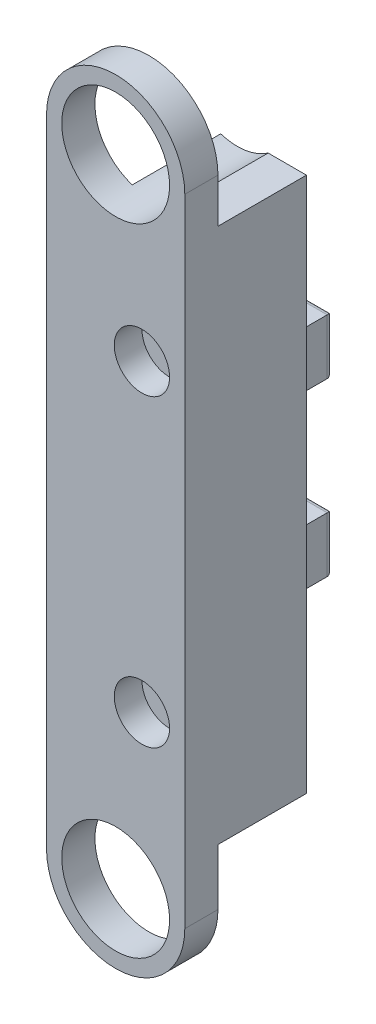
ISO-10303-21;
HEADER;
FILE_DESCRIPTION(('STEP AP214'),'2;1');
FILE_NAME('part.step','',(''),(''),'','','');
FILE_SCHEMA(('AUTOMOTIVE_DESIGN { 1 0 10303 214 1 1 1 1 }'));
ENDSEC;
DATA;
#1=APPLICATION_CONTEXT('core data for automotive mechanical design processes');
#2=APPLICATION_PROTOCOL_DEFINITION('international standard','automotive_design',2000,#1);
#3=PRODUCT_CONTEXT('',#1,'mechanical');
#4=PRODUCT('Part','Part','',(#3));
#5=PRODUCT_RELATED_PRODUCT_CATEGORY('part','',(#4));
#6=PRODUCT_DEFINITION_FORMATION('','',#4);
#7=PRODUCT_DEFINITION_CONTEXT('part definition',#1,'design');
#8=PRODUCT_DEFINITION('design','',#6,#7);
#9=PRODUCT_DEFINITION_SHAPE('','',#8);
#10=(LENGTH_UNIT() NAMED_UNIT(*) SI_UNIT(.MILLI.,.METRE.));
#11=(NAMED_UNIT(*) PLANE_ANGLE_UNIT() SI_UNIT($,.RADIAN.));
#12=(NAMED_UNIT(*) SI_UNIT($,.STERADIAN.) SOLID_ANGLE_UNIT());
#13=UNCERTAINTY_MEASURE_WITH_UNIT(LENGTH_MEASURE(1.E-05),#10,'distance_accuracy_value','');
#14=(GEOMETRIC_REPRESENTATION_CONTEXT(3) GLOBAL_UNCERTAINTY_ASSIGNED_CONTEXT((#13)) GLOBAL_UNIT_ASSIGNED_CONTEXT((#10,
#11,#12)) REPRESENTATION_CONTEXT('',''));
#15=CARTESIAN_POINT('',(0.,0.,0.));
#16=DIRECTION('',(0.,0.,1.));
#17=DIRECTION('',(1.,0.,0.));
#18=AXIS2_PLACEMENT_3D('',#15,#16,#17);
#19=CARTESIAN_POINT('',(12.5,0.,13.));
#20=DIRECTION('',(0.,0.,1.));
#21=DIRECTION('',(1.,0.,0.));
#22=AXIS2_PLACEMENT_3D('',#19,#20,#21);
#23=PLANE('',#22);
#24=DIRECTION('',(0.,-1.,0.));
#25=VECTOR('',#24,1.);
#26=CARTESIAN_POINT('',(7.24999999999999,68.,13.));
#27=LINE('',#26,#25);
#28=CARTESIAN_POINT('',(7.24999999999999,78.,13.));
#29=VERTEX_POINT('',#28);
#30=CARTESIAN_POINT('',(7.24999999999999,68.,13.));
#31=VERTEX_POINT('',#30);
#32=EDGE_CURVE('E276',#29,#31,#27,.T.);
#33=ORIENTED_EDGE('',*,*,#32,.F.);
#34=DIRECTION('',(1.,0.,0.));
#35=VECTOR('',#34,1.);
#36=CARTESIAN_POINT('',(2.24999999999999,78.,13.));
#37=LINE('',#36,#35);
#38=CARTESIAN_POINT('',(2.24999999999999,78.,13.));
#39=VERTEX_POINT('',#38);
#40=EDGE_CURVE('E285',#39,#29,#37,.T.);
#41=ORIENTED_EDGE('',*,*,#40,.F.);
#42=DIRECTION('',(0.,1.,0.));
#43=VECTOR('',#42,1.);
#44=CARTESIAN_POINT('',(2.24999999999999,68.,13.));
#45=LINE('',#44,#43);
#46=CARTESIAN_POINT('',(2.24999999999999,68.,13.));
#47=VERTEX_POINT('',#46);
#48=EDGE_CURVE('E282',#47,#39,#45,.T.);
#49=ORIENTED_EDGE('',*,*,#48,.F.);
#50=DIRECTION('',(-1.,0.,0.));
#51=VECTOR('',#50,1.);
#52=CARTESIAN_POINT('',(2.24999999999999,68.,13.));
#53=LINE('',#52,#51);
#54=EDGE_CURVE('E279',#31,#47,#53,.T.);
#55=ORIENTED_EDGE('',*,*,#54,.F.);
#56=EDGE_LOOP('',(#33,#41,#49,#55));
#57=FACE_BOUND('',#56,.T.);
#58=CARTESIAN_POINT('',(4.74999999999999,30.,13.));
#59=DIRECTION('',(0.,0.,-1.));
#60=DIRECTION('',(-1.,0.,0.));
#61=AXIS2_PLACEMENT_3D('',#58,#59,#60);
#62=CIRCLE('',#61,2.);
#63=CARTESIAN_POINT('',(2.74999999999999,30.,13.));
#64=VERTEX_POINT('',#63);
#65=EDGE_CURVE('E309',#64,#64,#62,.T.);
#66=ORIENTED_EDGE('',*,*,#65,.F.);
#67=EDGE_LOOP('',(#66));
#68=FACE_BOUND('',#67,.T.);
#69=CARTESIAN_POINT('',(4.74999999999999,85.,13.));
#70=DIRECTION('',(0.,0.,-1.));
#71=DIRECTION('',(-1.,0.,0.));
#72=AXIS2_PLACEMENT_3D('',#69,#70,#71);
#73=CIRCLE('',#72,2.);
#74=CARTESIAN_POINT('',(2.74999999999999,85.,13.));
#75=VERTEX_POINT('',#74);
#76=EDGE_CURVE('E313',#75,#75,#73,.T.);
#77=ORIENTED_EDGE('',*,*,#76,.F.);
#78=EDGE_LOOP('',(#77));
#79=FACE_BOUND('',#78,.T.);
#80=DIRECTION('',(-1.,0.,0.));
#81=VECTOR('',#80,1.);
#82=CARTESIAN_POINT('',(0.,107.,13.));
#83=LINE('',#82,#81);
#84=CARTESIAN_POINT('',(12.5,107.,13.));
#85=VERTEX_POINT('',#84);
#86=CARTESIAN_POINT('',(5.57337420240197,107.,13.));
#87=VERTEX_POINT('',#86);
#88=EDGE_CURVE('E382',#85,#87,#83,.T.);
#89=ORIENTED_EDGE('',*,*,#88,.F.);
#90=DIRECTION('',(0.,1.,0.));
#91=VECTOR('',#90,1.);
#92=CARTESIAN_POINT('',(12.5,0.,13.));
#93=LINE('',#92,#91);
#94=CARTESIAN_POINT('',(12.5,10.1740958378372,13.));
#95=VERTEX_POINT('',#94);
#96=EDGE_CURVE('E312',#95,#85,#93,.T.);
#97=ORIENTED_EDGE('',*,*,#96,.F.);
#98=DIRECTION('',(-1.,0.,0.));
#99=VECTOR('',#98,1.);
#100=CARTESIAN_POINT('',(0.,10.1740958378372,13.));
#101=LINE('',#100,#99);
#102=CARTESIAN_POINT('',(9.61705640424888,10.1740958378372,13.));
#103=VERTEX_POINT('',#102);
#104=EDGE_CURVE('E324',#95,#103,#101,.T.);
#105=ORIENTED_EDGE('',*,*,#104,.T.);
#106=CARTESIAN_POINT('',(0.,0.,13.));
#107=DIRECTION('',(0.,0.,1.));
#108=DIRECTION('',(1.,0.,0.));
#109=AXIS2_PLACEMENT_3D('',#106,#107,#108);
#110=CIRCLE('',#109,14.);
#111=CARTESIAN_POINT('',(0.,14.,13.));
#112=VERTEX_POINT('',#111);
#113=EDGE_CURVE('E321',#112,#103,#110,.F.);
#114=ORIENTED_EDGE('',*,*,#113,.F.);
#115=CARTESIAN_POINT('',(0.,26.5,13.));
#116=DIRECTION('',(0.,0.,1.));
#117=DIRECTION('',(1.,0.,0.));
#118=AXIS2_PLACEMENT_3D('',#115,#116,#117);
#119=CIRCLE('',#118,12.5);
#120=CARTESIAN_POINT('',(-2.99999999999999,14.3653389004884,13.));
#121=VERTEX_POINT('',#120);
#122=EDGE_CURVE('E351',#121,#112,#119,.T.);
#123=ORIENTED_EDGE('',*,*,#122,.F.);
#124=DIRECTION('',(0.,1.,0.));
#125=VECTOR('',#124,1.);
#126=CARTESIAN_POINT('',(-2.99999999999999,0.,13.));
#127=LINE('',#126,#125);
#128=CARTESIAN_POINT('',(-2.99999999999999,47.9080663039864,13.));
#129=VERTEX_POINT('',#128);
#130=EDGE_CURVE('E327',#121,#129,#127,.T.);
#131=ORIENTED_EDGE('',*,*,#130,.T.);
#132=CARTESIAN_POINT('',(-13.,58.,13.));
#133=DIRECTION('',(0.,0.,1.));
#134=DIRECTION('',(1.,0.,0.));
#135=AXIS2_PLACEMENT_3D('',#132,#133,#134);
#136=CIRCLE('',#135,14.2072912873896);
#137=CARTESIAN_POINT('',(-2.99999999999999,68.0919336960136,13.));
#138=VERTEX_POINT('',#137);
#139=EDGE_CURVE('E329',#129,#138,#136,.T.);
#140=ORIENTED_EDGE('',*,*,#139,.T.);
#141=DIRECTION('',(0.,1.,0.));
#142=VECTOR('',#141,1.);
#143=CARTESIAN_POINT('',(-2.99999999999999,0.,13.));
#144=LINE('',#143,#142);
#145=CARTESIAN_POINT('',(-2.99999999999999,105.72301234236,13.));
#146=VERTEX_POINT('',#145);
#147=EDGE_CURVE('E332',#138,#146,#144,.T.);
#148=ORIENTED_EDGE('',*,*,#147,.T.);
#149=CARTESIAN_POINT('',(0.,115.,13.));
#150=DIRECTION('',(0.,0.,1.));
#151=DIRECTION('',(1.,0.,0.));
#152=AXIS2_PLACEMENT_3D('',#149,#150,#151);
#153=CIRCLE('',#152,9.75);
#154=EDGE_CURVE('E319',#146,#87,#153,.T.);
#155=ORIENTED_EDGE('',*,*,#154,.T.);
#156=EDGE_LOOP('',(#89,#97,#105,#114,#123,#131,#140,#148,#155));
#157=FACE_BOUND('',#156,.T.);
#158=DIRECTION('',(0.,-1.,0.));
#159=VECTOR('',#158,1.);
#160=CARTESIAN_POINT('',(7.24999999999999,37.,13.));
#161=LINE('',#160,#159);
#162=CARTESIAN_POINT('',(7.24999999999999,47.,13.));
#163=VERTEX_POINT('',#162);
#164=CARTESIAN_POINT('',(7.24999999999999,37.,13.));
#165=VERTEX_POINT('',#164);
#166=EDGE_CURVE('E245',#163,#165,#161,.T.);
#167=ORIENTED_EDGE('',*,*,#166,.F.);
#168=DIRECTION('',(1.,0.,0.));
#169=VECTOR('',#168,1.);
#170=CARTESIAN_POINT('',(2.24999999999999,47.,13.));
#171=LINE('',#170,#169);
#172=CARTESIAN_POINT('',(2.24999999999998,47.,13.));
#173=VERTEX_POINT('',#172);
#174=EDGE_CURVE('E253',#173,#163,#171,.T.);
#175=ORIENTED_EDGE('',*,*,#174,.F.);
#176=DIRECTION('',(0.,1.,0.));
#177=VECTOR('',#176,1.);
#178=CARTESIAN_POINT('',(2.24999999999999,37.,13.));
#179=LINE('',#178,#177);
#180=CARTESIAN_POINT('',(2.24999999999998,37.,13.));
#181=VERTEX_POINT('',#180);
#182=EDGE_CURVE('E266',#181,#173,#179,.T.);
#183=ORIENTED_EDGE('',*,*,#182,.F.);
#184=DIRECTION('',(-1.,0.,0.));
#185=VECTOR('',#184,1.);
#186=CARTESIAN_POINT('',(2.24999999999999,37.,13.));
#187=LINE('',#186,#185);
#188=EDGE_CURVE('E261',#165,#181,#187,.T.);
#189=ORIENTED_EDGE('',*,*,#188,.F.);
#190=EDGE_LOOP('',(#167,#175,#183,#189));
#191=FACE_BOUND('',#190,.T.);
#192=ADVANCED_FACE('F73',(#57,#68,#79,#157,#191),#23,.F.);
#193=CARTESIAN_POINT('',(4.74999999999999,85.,35.));
#194=DIRECTION('',(0.,0.,-1.));
#195=DIRECTION('',(-1.,0.,0.));
#196=AXIS2_PLACEMENT_3D('',#193,#194,#195);
#197=CYLINDRICAL_SURFACE('',#196,2.);
#198=ORIENTED_EDGE('',*,*,#76,.T.);
#199=EDGE_LOOP('',(#198));
#200=FACE_BOUND('',#199,.T.);
#201=CARTESIAN_POINT('',(4.74999999999999,85.,30.));
#202=DIRECTION('',(0.,0.,1.));
#203=DIRECTION('',(1.,0.,0.));
#204=AXIS2_PLACEMENT_3D('',#201,#202,#203);
#205=CIRCLE('',#204,2.);
#206=CARTESIAN_POINT('',(6.74999999999999,85.,30.));
#207=VERTEX_POINT('',#206);
#208=EDGE_CURVE('E316',#207,#207,#205,.F.);
#209=ORIENTED_EDGE('',*,*,#208,.F.);
#210=EDGE_LOOP('',(#209));
#211=FACE_BOUND('',#210,.T.);
#212=ADVANCED_FACE('F513',(#200,#211),#197,.F.);
#213=CARTESIAN_POINT('',(4.74999999999999,30.,35.));
#214=DIRECTION('',(0.,0.,-1.));
#215=DIRECTION('',(-1.,0.,0.));
#216=AXIS2_PLACEMENT_3D('',#213,#214,#215);
#217=CYLINDRICAL_SURFACE('',#216,2.);
#218=ORIENTED_EDGE('',*,*,#65,.T.);
#219=EDGE_LOOP('',(#218));
#220=FACE_BOUND('',#219,.T.);
#221=CARTESIAN_POINT('',(4.74999999999999,30.,30.));
#222=DIRECTION('',(0.,0.,1.));
#223=DIRECTION('',(1.,0.,0.));
#224=AXIS2_PLACEMENT_3D('',#221,#222,#223);
#225=CIRCLE('',#224,2.);
#226=CARTESIAN_POINT('',(6.74999999999999,30.,30.));
#227=VERTEX_POINT('',#226);
#228=EDGE_CURVE('E300',#227,#227,#225,.F.);
#229=ORIENTED_EDGE('',*,*,#228,.F.);
#230=EDGE_LOOP('',(#229));
#231=FACE_BOUND('',#230,.T.);
#232=ADVANCED_FACE('F520',(#220,#231),#217,.F.);
#233=CARTESIAN_POINT('',(0.,115.,35.));
#234=DIRECTION('',(0.,0.,-1.));
#235=DIRECTION('',(-1.,0.,0.));
#236=AXIS2_PLACEMENT_3D('',#233,#234,#235);
#237=CYLINDRICAL_SURFACE('',#236,9.75);
#238=ORIENTED_EDGE('',*,*,#154,.F.);
#239=DIRECTION('',(0.,0.,1.));
#240=VECTOR('',#239,1.);
#241=CARTESIAN_POINT('',(-2.99999999999999,105.72301234236,13.));
#242=LINE('',#241,#240);
#243=CARTESIAN_POINT('',(-2.99999999999999,105.72301234236,29.));
#244=VERTEX_POINT('',#243);
#245=EDGE_CURVE('E341',#146,#244,#242,.T.);
#246=ORIENTED_EDGE('',*,*,#245,.T.);
#247=CARTESIAN_POINT('',(0.,115.,29.));
#248=DIRECTION('',(0.,0.,1.));
#249=DIRECTION('',(1.,0.,0.));
#250=AXIS2_PLACEMENT_3D('',#247,#248,#249);
#251=CIRCLE('',#250,9.75);
#252=CARTESIAN_POINT('',(5.57337420240197,107.,29.));
#253=VERTEX_POINT('',#252);
#254=EDGE_CURVE('E386',#244,#253,#251,.F.);
#255=ORIENTED_EDGE('',*,*,#254,.T.);
#256=DIRECTION('',(0.,0.,1.));
#257=VECTOR('',#256,1.);
#258=CARTESIAN_POINT('',(5.57337420240197,107.,13.));
#259=LINE('',#258,#257);
#260=EDGE_CURVE('E360',#87,#253,#259,.T.);
#261=ORIENTED_EDGE('',*,*,#260,.F.);
#262=EDGE_LOOP('',(#238,#246,#255,#261));
#263=FACE_BOUND('',#262,.T.);
#264=CARTESIAN_POINT('',(0.,115.,35.));
#265=DIRECTION('',(0.,0.,1.));
#266=DIRECTION('',(1.,0.,0.));
#267=AXIS2_PLACEMENT_3D('',#264,#265,#266);
#268=CIRCLE('',#267,9.75);
#269=CARTESIAN_POINT('',(9.75,115.,35.));
#270=VERTEX_POINT('',#269);
#271=EDGE_CURVE('E409',#270,#270,#268,.T.);
#272=ORIENTED_EDGE('',*,*,#271,.T.);
#273=EDGE_LOOP('',(#272));
#274=FACE_BOUND('',#273,.T.);
#275=ADVANCED_FACE('F569',(#263,#274),#237,.F.);
#276=CARTESIAN_POINT('',(-12.5,0.,35.));
#277=DIRECTION('',(1.,0.,0.));
#278=DIRECTION('',(0.,1.,0.));
#279=AXIS2_PLACEMENT_3D('',#276,#277,#278);
#280=PLANE('',#279);
#281=DIRECTION('',(0.,0.,-1.));
#282=VECTOR('',#281,1.);
#283=CARTESIAN_POINT('',(-12.5,115.,35.));
#284=LINE('',#283,#282);
#285=CARTESIAN_POINT('',(-12.5,115.,35.));
#286=VERTEX_POINT('',#285);
#287=CARTESIAN_POINT('',(-12.5,115.,29.));
#288=VERTEX_POINT('',#287);
#289=EDGE_CURVE('E421',#286,#288,#284,.T.);
#290=ORIENTED_EDGE('',*,*,#289,.T.);
#291=DIRECTION('',(0.,-1.,0.));
#292=VECTOR('',#291,1.);
#293=CARTESIAN_POINT('',(-12.5,0.,29.));
#294=LINE('',#293,#292);
#295=CARTESIAN_POINT('',(-12.5,0.,29.));
#296=VERTEX_POINT('',#295);
#297=EDGE_CURVE('E368',#288,#296,#294,.T.);
#298=ORIENTED_EDGE('',*,*,#297,.T.);
#299=DIRECTION('',(0.,0.,-1.));
#300=VECTOR('',#299,1.);
#301=CARTESIAN_POINT('',(-12.5,0.,35.));
#302=LINE('',#301,#300);
#303=CARTESIAN_POINT('',(-12.5,0.,35.));
#304=VERTEX_POINT('',#303);
#305=EDGE_CURVE('E418',#304,#296,#302,.T.);
#306=ORIENTED_EDGE('',*,*,#305,.F.);
#307=DIRECTION('',(0.,-1.,0.));
#308=VECTOR('',#307,1.);
#309=CARTESIAN_POINT('',(-12.5,0.,35.));
#310=LINE('',#309,#308);
#311=EDGE_CURVE('E405',#286,#304,#310,.T.);
#312=ORIENTED_EDGE('',*,*,#311,.F.);
#313=EDGE_LOOP('',(#290,#298,#306,#312));
#314=FACE_BOUND('',#313,.T.);
#315=ADVANCED_FACE('F572',(#314),#280,.F.);
#316=CARTESIAN_POINT('',(12.5,0.,35.));
#317=DIRECTION('',(1.,0.,0.));
#318=DIRECTION('',(0.,1.,0.));
#319=AXIS2_PLACEMENT_3D('',#316,#317,#318);
#320=PLANE('',#319);
#321=ORIENTED_EDGE('',*,*,#96,.T.);
#322=DIRECTION('',(0.,0.,1.));
#323=VECTOR('',#322,1.);
#324=CARTESIAN_POINT('',(12.5,107.,13.));
#325=LINE('',#324,#323);
#326=CARTESIAN_POINT('',(12.5,107.,29.));
#327=VERTEX_POINT('',#326);
#328=EDGE_CURVE('E385',#85,#327,#325,.T.);
#329=ORIENTED_EDGE('',*,*,#328,.T.);
#330=DIRECTION('',(0.,1.,0.));
#331=VECTOR('',#330,1.);
#332=CARTESIAN_POINT('',(12.5,0.,29.));
#333=LINE('',#332,#331);
#334=CARTESIAN_POINT('',(12.5,115.,29.));
#335=VERTEX_POINT('',#334);
#336=EDGE_CURVE('E389',#327,#335,#333,.T.);
#337=ORIENTED_EDGE('',*,*,#336,.T.);
#338=DIRECTION('',(0.,0.,-1.));
#339=VECTOR('',#338,1.);
#340=CARTESIAN_POINT('',(12.5,115.,35.));
#341=LINE('',#340,#339);
#342=CARTESIAN_POINT('',(12.5,115.,35.));
#343=VERTEX_POINT('',#342);
#344=EDGE_CURVE('E424',#343,#335,#341,.T.);
#345=ORIENTED_EDGE('',*,*,#344,.F.);
#346=DIRECTION('',(0.,-1.,0.));
#347=VECTOR('',#346,1.);
#348=CARTESIAN_POINT('',(12.5,0.,35.));
#349=LINE('',#348,#347);
#350=CARTESIAN_POINT('',(12.5,0.,35.));
#351=VERTEX_POINT('',#350);
#352=EDGE_CURVE('E378',#343,#351,#349,.T.);
#353=ORIENTED_EDGE('',*,*,#352,.T.);
#354=DIRECTION('',(0.,0.,-1.));
#355=VECTOR('',#354,1.);
#356=CARTESIAN_POINT('',(12.5,0.,35.));
#357=LINE('',#356,#355);
#358=CARTESIAN_POINT('',(12.5,0.,29.));
#359=VERTEX_POINT('',#358);
#360=EDGE_CURVE('E415',#351,#359,#357,.T.);
#361=ORIENTED_EDGE('',*,*,#360,.T.);
#362=DIRECTION('',(0.,1.,0.));
#363=VECTOR('',#362,1.);
#364=CARTESIAN_POINT('',(12.5,0.,29.));
#365=LINE('',#364,#363);
#366=CARTESIAN_POINT('',(12.5,10.1740958378372,29.));
#367=VERTEX_POINT('',#366);
#368=EDGE_CURVE('E356',#359,#367,#365,.T.);
#369=ORIENTED_EDGE('',*,*,#368,.T.);
#370=DIRECTION('',(0.,0.,1.));
#371=VECTOR('',#370,1.);
#372=CARTESIAN_POINT('',(12.5,10.1740958378372,13.));
#373=LINE('',#372,#371);
#374=EDGE_CURVE('E354',#95,#367,#373,.T.);
#375=ORIENTED_EDGE('',*,*,#374,.F.);
#376=EDGE_LOOP('',(#321,#329,#337,#345,#353,#361,#369,#375));
#377=FACE_BOUND('',#376,.T.);
#378=ADVANCED_FACE('F579',(#377),#320,.T.);
#379=CARTESIAN_POINT('',(0.,115.,35.));
#380=DIRECTION('',(0.,0.,-1.));
#381=DIRECTION('',(-1.,0.,0.));
#382=AXIS2_PLACEMENT_3D('',#379,#380,#381);
#383=CYLINDRICAL_SURFACE('',#382,12.5);
#384=ORIENTED_EDGE('',*,*,#344,.T.);
#385=CARTESIAN_POINT('',(0.,115.,29.));
#386=DIRECTION('',(0.,0.,1.));
#387=DIRECTION('',(1.,0.,0.));
#388=AXIS2_PLACEMENT_3D('',#385,#386,#387);
#389=CIRCLE('',#388,12.5);
#390=EDGE_CURVE('E392',#335,#288,#389,.T.);
#391=ORIENTED_EDGE('',*,*,#390,.T.);
#392=ORIENTED_EDGE('',*,*,#289,.F.);
#393=CARTESIAN_POINT('',(0.,115.,35.));
#394=DIRECTION('',(0.,0.,1.));
#395=DIRECTION('',(1.,0.,0.));
#396=AXIS2_PLACEMENT_3D('',#393,#394,#395);
#397=CIRCLE('',#396,12.5);
#398=EDGE_CURVE('E402',#343,#286,#397,.T.);
#399=ORIENTED_EDGE('',*,*,#398,.F.);
#400=EDGE_LOOP('',(#384,#391,#392,#399));
#401=FACE_BOUND('',#400,.T.);
#402=ADVANCED_FACE('F564',(#401),#383,.T.);
#403=CARTESIAN_POINT('',(0.,0.,35.));
#404=DIRECTION('',(0.,0.,1.));
#405=DIRECTION('',(1.,0.,0.));
#406=AXIS2_PLACEMENT_3D('',#403,#404,#405);
#407=PLANE('',#406);
#408=CARTESIAN_POINT('',(4.74999999999999,85.,35.));
#409=DIRECTION('',(0.,0.,1.));
#410=DIRECTION('',(1.,0.,0.));
#411=AXIS2_PLACEMENT_3D('',#408,#409,#410);
#412=CIRCLE('',#411,5.);
#413=CARTESIAN_POINT('',(9.74999999999999,85.,35.));
#414=VERTEX_POINT('',#413);
#415=EDGE_CURVE('E301',#414,#414,#412,.T.);
#416=ORIENTED_EDGE('',*,*,#415,.F.);
#417=EDGE_LOOP('',(#416));
#418=FACE_BOUND('',#417,.T.);
#419=CARTESIAN_POINT('',(4.74999999999999,30.,35.));
#420=DIRECTION('',(0.,0.,1.));
#421=DIRECTION('',(1.,0.,0.));
#422=AXIS2_PLACEMENT_3D('',#419,#420,#421);
#423=CIRCLE('',#422,5.);
#424=CARTESIAN_POINT('',(9.74999999999999,30.,35.));
#425=VERTEX_POINT('',#424);
#426=EDGE_CURVE('E296',#425,#425,#423,.T.);
#427=ORIENTED_EDGE('',*,*,#426,.F.);
#428=EDGE_LOOP('',(#427));
#429=FACE_BOUND('',#428,.T.);
#430=ORIENTED_EDGE('',*,*,#398,.T.);
#431=ORIENTED_EDGE('',*,*,#311,.T.);
#432=CARTESIAN_POINT('',(0.,0.,35.));
#433=DIRECTION('',(0.,0.,1.));
#434=DIRECTION('',(1.,0.,0.));
#435=AXIS2_PLACEMENT_3D('',#432,#433,#434);
#436=CIRCLE('',#435,12.5);
#437=EDGE_CURVE('E407',#304,#351,#436,.T.);
#438=ORIENTED_EDGE('',*,*,#437,.T.);
#439=ORIENTED_EDGE('',*,*,#352,.F.);
#440=EDGE_LOOP('',(#430,#431,#438,#439));
#441=FACE_BOUND('',#440,.T.);
#442=ORIENTED_EDGE('',*,*,#271,.F.);
#443=EDGE_LOOP('',(#442));
#444=FACE_BOUND('',#443,.T.);
#445=CARTESIAN_POINT('',(0.,0.,35.));
#446=DIRECTION('',(0.,0.,1.));
#447=DIRECTION('',(1.,0.,0.));
#448=AXIS2_PLACEMENT_3D('',#445,#446,#447);
#449=CIRCLE('',#448,9.75);
#450=CARTESIAN_POINT('',(9.75,0.,35.));
#451=VERTEX_POINT('',#450);
#452=EDGE_CURVE('E412',#451,#451,#449,.T.);
#453=ORIENTED_EDGE('',*,*,#452,.F.);
#454=EDGE_LOOP('',(#453));
#455=FACE_BOUND('',#454,.T.);
#456=ADVANCED_FACE('F551',(#418,#429,#441,#444,#455),#407,.T.);
#457=CARTESIAN_POINT('',(0.,0.,35.));
#458=DIRECTION('',(0.,0.,-1.));
#459=DIRECTION('',(-1.,0.,0.));
#460=AXIS2_PLACEMENT_3D('',#457,#458,#459);
#461=CYLINDRICAL_SURFACE('',#460,12.5);
#462=ORIENTED_EDGE('',*,*,#305,.T.);
#463=CARTESIAN_POINT('',(0.,0.,29.));
#464=DIRECTION('',(0.,0.,1.));
#465=DIRECTION('',(1.,0.,0.));
#466=AXIS2_PLACEMENT_3D('',#463,#464,#465);
#467=CIRCLE('',#466,12.5);
#468=EDGE_CURVE('E371',#296,#359,#467,.T.);
#469=ORIENTED_EDGE('',*,*,#468,.T.);
#470=ORIENTED_EDGE('',*,*,#360,.F.);
#471=ORIENTED_EDGE('',*,*,#437,.F.);
#472=EDGE_LOOP('',(#462,#469,#470,#471));
#473=FACE_BOUND('',#472,.T.);
#474=ADVANCED_FACE('F563',(#473),#461,.T.);
#475=CARTESIAN_POINT('',(0.,0.,35.));
#476=DIRECTION('',(0.,0.,-1.));
#477=DIRECTION('',(-1.,0.,0.));
#478=AXIS2_PLACEMENT_3D('',#475,#476,#477);
#479=CYLINDRICAL_SURFACE('',#478,9.75);
#480=CARTESIAN_POINT('',(0.,0.,29.));
#481=DIRECTION('',(0.,0.,1.));
#482=DIRECTION('',(1.,0.,0.));
#483=AXIS2_PLACEMENT_3D('',#480,#481,#482);
#484=CIRCLE('',#483,9.75);
#485=CARTESIAN_POINT('',(9.75,0.,29.));
#486=VERTEX_POINT('',#485);
#487=EDGE_CURVE('E355',#486,#486,#484,.F.);
#488=ORIENTED_EDGE('',*,*,#487,.T.);
#489=EDGE_LOOP('',(#488));
#490=FACE_BOUND('',#489,.T.);
#491=ORIENTED_EDGE('',*,*,#452,.T.);
#492=EDGE_LOOP('',(#491));
#493=FACE_BOUND('',#492,.T.);
#494=ADVANCED_FACE('F549',(#490,#493),#479,.F.);
#495=CARTESIAN_POINT('',(0.,26.5,13.));
#496=DIRECTION('',(0.,0.,1.));
#497=DIRECTION('',(1.,0.,0.));
#498=AXIS2_PLACEMENT_3D('',#495,#496,#497);
#499=CYLINDRICAL_SURFACE('',#498,12.5);
#500=DIRECTION('',(0.,0.,1.));
#501=VECTOR('',#500,1.);
#502=CARTESIAN_POINT('',(-2.99999999999999,14.3653389004884,13.));
#503=LINE('',#502,#501);
#504=CARTESIAN_POINT('',(-2.99999999999999,14.3653389004884,29.));
#505=VERTEX_POINT('',#504);
#506=EDGE_CURVE('E344',#121,#505,#503,.T.);
#507=ORIENTED_EDGE('',*,*,#506,.F.);
#508=ORIENTED_EDGE('',*,*,#122,.T.);
#509=DIRECTION('',(0.,0.,1.));
#510=VECTOR('',#509,1.);
#511=CARTESIAN_POINT('',(0.,14.,13.));
#512=LINE('',#511,#510);
#513=CARTESIAN_POINT('',(0.,14.,29.));
#514=VERTEX_POINT('',#513);
#515=EDGE_CURVE('E375',#112,#514,#512,.T.);
#516=ORIENTED_EDGE('',*,*,#515,.T.);
#517=CARTESIAN_POINT('',(0.,26.5,29.));
#518=DIRECTION('',(0.,0.,1.));
#519=DIRECTION('',(1.,0.,0.));
#520=AXIS2_PLACEMENT_3D('',#517,#518,#519);
#521=CIRCLE('',#520,12.5);
#522=EDGE_CURVE('E366',#505,#514,#521,.T.);
#523=ORIENTED_EDGE('',*,*,#522,.F.);
#524=EDGE_LOOP('',(#507,#508,#516,#523));
#525=FACE_BOUND('',#524,.T.);
#526=ADVANCED_FACE('F545',(#525),#499,.T.);
#527=CARTESIAN_POINT('',(0.,0.,13.));
#528=DIRECTION('',(0.,0.,1.));
#529=DIRECTION('',(1.,0.,0.));
#530=AXIS2_PLACEMENT_3D('',#527,#528,#529);
#531=CYLINDRICAL_SURFACE('',#530,14.);
#532=ORIENTED_EDGE('',*,*,#515,.F.);
#533=ORIENTED_EDGE('',*,*,#113,.T.);
#534=DIRECTION('',(0.,0.,1.));
#535=VECTOR('',#534,1.);
#536=CARTESIAN_POINT('',(9.61705640424889,10.1740958378372,13.));
#537=LINE('',#536,#535);
#538=CARTESIAN_POINT('',(9.61705640424889,10.1740958378372,29.));
#539=VERTEX_POINT('',#538);
#540=EDGE_CURVE('E379',#103,#539,#537,.T.);
#541=ORIENTED_EDGE('',*,*,#540,.T.);
#542=CARTESIAN_POINT('',(0.,0.,29.));
#543=DIRECTION('',(0.,0.,1.));
#544=DIRECTION('',(1.,0.,0.));
#545=AXIS2_PLACEMENT_3D('',#542,#543,#544);
#546=CIRCLE('',#545,14.);
#547=EDGE_CURVE('E363',#539,#514,#546,.T.);
#548=ORIENTED_EDGE('',*,*,#547,.T.);
#549=EDGE_LOOP('',(#532,#533,#541,#548));
#550=FACE_BOUND('',#549,.T.);
#551=ADVANCED_FACE('F548',(#550),#531,.F.);
#552=CARTESIAN_POINT('',(0.,10.1740958378372,13.));
#553=DIRECTION('',(0.,-1.,0.));
#554=DIRECTION('',(1.,0.,0.));
#555=AXIS2_PLACEMENT_3D('',#552,#553,#554);
#556=PLANE('',#555);
#557=ORIENTED_EDGE('',*,*,#104,.F.);
#558=ORIENTED_EDGE('',*,*,#374,.T.);
#559=DIRECTION('',(1.,0.,0.));
#560=VECTOR('',#559,1.);
#561=CARTESIAN_POINT('',(0.,10.1740958378372,29.));
#562=LINE('',#561,#560);
#563=EDGE_CURVE('E359',#539,#367,#562,.T.);
#564=ORIENTED_EDGE('',*,*,#563,.F.);
#565=ORIENTED_EDGE('',*,*,#540,.F.);
#566=EDGE_LOOP('',(#557,#558,#564,#565));
#567=FACE_BOUND('',#566,.T.);
#568=ADVANCED_FACE('F543',(#567),#556,.T.);
#569=CARTESIAN_POINT('',(0.,0.,29.));
#570=DIRECTION('',(0.,0.,1.));
#571=DIRECTION('',(1.,0.,0.));
#572=AXIS2_PLACEMENT_3D('',#569,#570,#571);
#573=PLANE('',#572);
#574=ORIENTED_EDGE('',*,*,#297,.F.);
#575=ORIENTED_EDGE('',*,*,#390,.F.);
#576=ORIENTED_EDGE('',*,*,#336,.F.);
#577=DIRECTION('',(-1.,0.,0.));
#578=VECTOR('',#577,1.);
#579=CARTESIAN_POINT('',(0.,107.,29.));
#580=LINE('',#579,#578);
#581=EDGE_CURVE('E350',#327,#253,#580,.T.);
#582=ORIENTED_EDGE('',*,*,#581,.T.);
#583=ORIENTED_EDGE('',*,*,#254,.F.);
#584=DIRECTION('',(0.,1.,0.));
#585=VECTOR('',#584,1.);
#586=CARTESIAN_POINT('',(-2.99999999999999,0.,29.));
#587=LINE('',#586,#585);
#588=CARTESIAN_POINT('',(-2.99999999999999,68.0919336960136,29.));
#589=VERTEX_POINT('',#588);
#590=EDGE_CURVE('E330',#589,#244,#587,.T.);
#591=ORIENTED_EDGE('',*,*,#590,.F.);
#592=CARTESIAN_POINT('',(-13.,58.,29.));
#593=DIRECTION('',(0.,0.,1.));
#594=DIRECTION('',(1.,0.,0.));
#595=AXIS2_PLACEMENT_3D('',#592,#593,#594);
#596=CIRCLE('',#595,14.2072912873896);
#597=CARTESIAN_POINT('',(-2.99999999999999,47.9080663039864,29.));
#598=VERTEX_POINT('',#597);
#599=EDGE_CURVE('E336',#598,#589,#596,.T.);
#600=ORIENTED_EDGE('',*,*,#599,.F.);
#601=DIRECTION('',(0.,1.,0.));
#602=VECTOR('',#601,1.);
#603=CARTESIAN_POINT('',(-2.99999999999999,0.,29.));
#604=LINE('',#603,#602);
#605=EDGE_CURVE('E326',#505,#598,#604,.T.);
#606=ORIENTED_EDGE('',*,*,#605,.F.);
#607=ORIENTED_EDGE('',*,*,#522,.T.);
#608=ORIENTED_EDGE('',*,*,#547,.F.);
#609=ORIENTED_EDGE('',*,*,#563,.T.);
#610=ORIENTED_EDGE('',*,*,#368,.F.);
#611=ORIENTED_EDGE('',*,*,#468,.F.);
#612=EDGE_LOOP('',(#574,#575,#576,#582,#583,#591,#600,#606,#607,#608,#609,#610,#611));
#613=FACE_BOUND('',#612,.T.);
#614=ORIENTED_EDGE('',*,*,#487,.F.);
#615=EDGE_LOOP('',(#614));
#616=FACE_BOUND('',#615,.T.);
#617=ADVANCED_FACE('F540',(#613,#616),#573,.F.);
#618=CARTESIAN_POINT('',(0.,107.,13.));
#619=DIRECTION('',(0.,1.,0.));
#620=DIRECTION('',(0.,0.,1.));
#621=AXIS2_PLACEMENT_3D('',#618,#619,#620);
#622=PLANE('',#621);
#623=ORIENTED_EDGE('',*,*,#581,.F.);
#624=ORIENTED_EDGE('',*,*,#328,.F.);
#625=ORIENTED_EDGE('',*,*,#88,.T.);
#626=ORIENTED_EDGE('',*,*,#260,.T.);
#627=EDGE_LOOP('',(#623,#624,#625,#626));
#628=FACE_BOUND('',#627,.T.);
#629=ADVANCED_FACE('F530',(#628),#622,.T.);
#630=CARTESIAN_POINT('',(-2.99999999999999,0.,13.));
#631=DIRECTION('',(1.,0.,0.));
#632=DIRECTION('',(0.,1.,0.));
#633=AXIS2_PLACEMENT_3D('',#630,#631,#632);
#634=PLANE('',#633);
#635=ORIENTED_EDGE('',*,*,#590,.T.);
#636=ORIENTED_EDGE('',*,*,#245,.F.);
#637=ORIENTED_EDGE('',*,*,#147,.F.);
#638=DIRECTION('',(0.,0.,1.));
#639=VECTOR('',#638,1.);
#640=CARTESIAN_POINT('',(-2.99999999999999,68.0919336960136,13.));
#641=LINE('',#640,#639);
#642=EDGE_CURVE('E345',#138,#589,#641,.T.);
#643=ORIENTED_EDGE('',*,*,#642,.T.);
#644=EDGE_LOOP('',(#635,#636,#637,#643));
#645=FACE_BOUND('',#644,.T.);
#646=ADVANCED_FACE('F526',(#645),#634,.F.);
#647=CARTESIAN_POINT('',(-13.,58.,13.));
#648=DIRECTION('',(0.,0.,1.));
#649=DIRECTION('',(1.,0.,0.));
#650=AXIS2_PLACEMENT_3D('',#647,#648,#649);
#651=CYLINDRICAL_SURFACE('',#650,14.2072912873896);
#652=ORIENTED_EDGE('',*,*,#599,.T.);
#653=ORIENTED_EDGE('',*,*,#642,.F.);
#654=ORIENTED_EDGE('',*,*,#139,.F.);
#655=DIRECTION('',(0.,0.,1.));
#656=VECTOR('',#655,1.);
#657=CARTESIAN_POINT('',(-2.99999999999999,47.9080663039864,13.));
#658=LINE('',#657,#656);
#659=EDGE_CURVE('E334',#129,#598,#658,.T.);
#660=ORIENTED_EDGE('',*,*,#659,.T.);
#661=EDGE_LOOP('',(#652,#653,#654,#660));
#662=FACE_BOUND('',#661,.T.);
#663=ADVANCED_FACE('F529',(#662),#651,.F.);
#664=CARTESIAN_POINT('',(-2.99999999999999,0.,13.));
#665=DIRECTION('',(1.,0.,0.));
#666=DIRECTION('',(0.,1.,0.));
#667=AXIS2_PLACEMENT_3D('',#664,#665,#666);
#668=PLANE('',#667);
#669=ORIENTED_EDGE('',*,*,#506,.T.);
#670=ORIENTED_EDGE('',*,*,#605,.T.);
#671=ORIENTED_EDGE('',*,*,#659,.F.);
#672=ORIENTED_EDGE('',*,*,#130,.F.);
#673=EDGE_LOOP('',(#669,#670,#671,#672));
#674=FACE_BOUND('',#673,.T.);
#675=ADVANCED_FACE('F534',(#674),#668,.F.);
#676=CARTESIAN_POINT('',(4.74999999999999,30.,30.));
#677=DIRECTION('',(0.,0.,1.));
#678=DIRECTION('',(1.,0.,0.));
#679=AXIS2_PLACEMENT_3D('',#676,#677,#678);
#680=PLANE('',#679);
#681=CARTESIAN_POINT('',(4.74999999999999,30.,30.));
#682=DIRECTION('',(0.,0.,1.));
#683=DIRECTION('',(1.,0.,0.));
#684=AXIS2_PLACEMENT_3D('',#681,#682,#683);
#685=CIRCLE('',#684,5.);
#686=CARTESIAN_POINT('',(9.74999999999999,30.,30.));
#687=VERTEX_POINT('',#686);
#688=EDGE_CURVE('E304',#687,#687,#685,.T.);
#689=ORIENTED_EDGE('',*,*,#688,.T.);
#690=EDGE_LOOP('',(#689));
#691=FACE_BOUND('',#690,.T.);
#692=ORIENTED_EDGE('',*,*,#228,.T.);
#693=EDGE_LOOP('',(#692));
#694=FACE_BOUND('',#693,.T.);
#695=ADVANCED_FACE('F538',(#691,#694),#680,.T.);
#696=CARTESIAN_POINT('',(4.74999999999999,30.,30.));
#697=DIRECTION('',(0.,0.,1.));
#698=DIRECTION('',(1.,0.,0.));
#699=AXIS2_PLACEMENT_3D('',#696,#697,#698);
#700=CYLINDRICAL_SURFACE('',#699,5.);
#701=ORIENTED_EDGE('',*,*,#688,.F.);
#702=EDGE_LOOP('',(#701));
#703=FACE_BOUND('',#702,.T.);
#704=ORIENTED_EDGE('',*,*,#426,.T.);
#705=EDGE_LOOP('',(#704));
#706=FACE_BOUND('',#705,.T.);
#707=ADVANCED_FACE('F722',(#703,#706),#700,.F.);
#708=CARTESIAN_POINT('',(4.74999999999999,85.,30.));
#709=DIRECTION('',(0.,0.,1.));
#710=DIRECTION('',(1.,0.,0.));
#711=AXIS2_PLACEMENT_3D('',#708,#709,#710);
#712=PLANE('',#711);
#713=CARTESIAN_POINT('',(4.74999999999999,85.,30.));
#714=DIRECTION('',(0.,0.,1.));
#715=DIRECTION('',(1.,0.,0.));
#716=AXIS2_PLACEMENT_3D('',#713,#714,#715);
#717=CIRCLE('',#716,5.);
#718=CARTESIAN_POINT('',(9.74999999999999,85.,30.));
#719=VERTEX_POINT('',#718);
#720=EDGE_CURVE('E297',#719,#719,#717,.T.);
#721=ORIENTED_EDGE('',*,*,#720,.T.);
#722=EDGE_LOOP('',(#721));
#723=FACE_BOUND('',#722,.T.);
#724=ORIENTED_EDGE('',*,*,#208,.T.);
#725=EDGE_LOOP('',(#724));
#726=FACE_BOUND('',#725,.T.);
#727=ADVANCED_FACE('F711',(#723,#726),#712,.T.);
#728=CARTESIAN_POINT('',(4.74999999999999,85.,30.));
#729=DIRECTION('',(0.,0.,1.));
#730=DIRECTION('',(1.,0.,0.));
#731=AXIS2_PLACEMENT_3D('',#728,#729,#730);
#732=CYLINDRICAL_SURFACE('',#731,5.);
#733=ORIENTED_EDGE('',*,*,#720,.F.);
#734=EDGE_LOOP('',(#733));
#735=FACE_BOUND('',#734,.T.);
#736=ORIENTED_EDGE('',*,*,#415,.T.);
#737=EDGE_LOOP('',(#736));
#738=FACE_BOUND('',#737,.T.);
#739=ADVANCED_FACE('F696',(#735,#738),#732,.F.);
#740=CARTESIAN_POINT('',(7.24999999999999,68.,3.));
#741=DIRECTION('',(-1.,0.,0.));
#742=DIRECTION('',(0.,0.,1.));
#743=AXIS2_PLACEMENT_3D('',#740,#741,#742);
#744=PLANE('',#743);
#745=DIRECTION('',(0.,0.,1.));
#746=VECTOR('',#745,1.);
#747=CARTESIAN_POINT('',(7.24999999999999,68.,3.));
#748=LINE('',#747,#746);
#749=CARTESIAN_POINT('',(7.24999999999999,68.,4.));
#750=VERTEX_POINT('',#749);
#751=EDGE_CURVE('E294',#750,#31,#748,.T.);
#752=ORIENTED_EDGE('',*,*,#751,.F.);
#753=DIRECTION('',(0.,-1.,0.));
#754=VECTOR('',#753,1.);
#755=CARTESIAN_POINT('',(7.24999999999999,78.,4.));
#756=LINE('',#755,#754);
#757=CARTESIAN_POINT('',(7.24999999999999,78.,4.));
#758=VERTEX_POINT('',#757);
#759=EDGE_CURVE('E12',#750,#758,#756,.F.);
#760=ORIENTED_EDGE('',*,*,#759,.T.);
#761=DIRECTION('',(0.,0.,1.));
#762=VECTOR('',#761,1.);
#763=CARTESIAN_POINT('',(7.24999999999999,78.,3.));
#764=LINE('',#763,#762);
#765=EDGE_CURVE('E288',#758,#29,#764,.T.);
#766=ORIENTED_EDGE('',*,*,#765,.T.);
#767=ORIENTED_EDGE('',*,*,#32,.T.);
#768=EDGE_LOOP('',(#752,#760,#766,#767));
#769=FACE_BOUND('',#768,.T.);
#770=ADVANCED_FACE('F491',(#769),#744,.F.);
#771=CARTESIAN_POINT('',(2.24999999999999,68.,3.));
#772=DIRECTION('',(0.,1.,0.));
#773=DIRECTION('',(0.,0.,1.));
#774=AXIS2_PLACEMENT_3D('',#771,#772,#773);
#775=PLANE('',#774);
#776=DIRECTION('',(0.,0.,1.));
#777=VECTOR('',#776,1.);
#778=CARTESIAN_POINT('',(2.24999999999999,68.,3.));
#779=LINE('',#778,#777);
#780=CARTESIAN_POINT('',(2.24999999999999,68.,4.));
#781=VERTEX_POINT('',#780);
#782=EDGE_CURVE('E292',#781,#47,#779,.T.);
#783=ORIENTED_EDGE('',*,*,#782,.F.);
#784=DIRECTION('',(-1.,0.,0.));
#785=VECTOR('',#784,1.);
#786=CARTESIAN_POINT('',(7.24999999999999,68.,4.));
#787=LINE('',#786,#785);
#788=EDGE_CURVE('E82',#781,#750,#787,.F.);
#789=ORIENTED_EDGE('',*,*,#788,.T.);
#790=ORIENTED_EDGE('',*,*,#751,.T.);
#791=ORIENTED_EDGE('',*,*,#54,.T.);
#792=EDGE_LOOP('',(#783,#789,#790,#791));
#793=FACE_BOUND('',#792,.T.);
#794=ADVANCED_FACE('F680',(#793),#775,.F.);
#795=CARTESIAN_POINT('',(2.24999999999999,68.,3.));
#796=DIRECTION('',(1.,0.,0.));
#797=DIRECTION('',(0.,0.,-1.));
#798=AXIS2_PLACEMENT_3D('',#795,#796,#797);
#799=PLANE('',#798);
#800=DIRECTION('',(0.,0.,1.));
#801=VECTOR('',#800,1.);
#802=CARTESIAN_POINT('',(2.24999999999999,78.,3.));
#803=LINE('',#802,#801);
#804=CARTESIAN_POINT('',(2.24999999999999,78.,4.));
#805=VERTEX_POINT('',#804);
#806=EDGE_CURVE('E290',#805,#39,#803,.T.);
#807=ORIENTED_EDGE('',*,*,#806,.F.);
#808=DIRECTION('',(0.,1.,0.));
#809=VECTOR('',#808,1.);
#810=CARTESIAN_POINT('',(2.24999999999999,68.,4.));
#811=LINE('',#810,#809);
#812=EDGE_CURVE('E97',#805,#781,#811,.F.);
#813=ORIENTED_EDGE('',*,*,#812,.T.);
#814=ORIENTED_EDGE('',*,*,#782,.T.);
#815=ORIENTED_EDGE('',*,*,#48,.T.);
#816=EDGE_LOOP('',(#807,#813,#814,#815));
#817=FACE_BOUND('',#816,.T.);
#818=ADVANCED_FACE('F510',(#817),#799,.F.);
#819=CARTESIAN_POINT('',(2.24999999999999,78.,3.));
#820=DIRECTION('',(0.,-1.,0.));
#821=DIRECTION('',(0.,0.,-1.));
#822=AXIS2_PLACEMENT_3D('',#819,#820,#821);
#823=PLANE('',#822);
#824=ORIENTED_EDGE('',*,*,#765,.F.);
#825=DIRECTION('',(1.,0.,0.));
#826=VECTOR('',#825,1.);
#827=CARTESIAN_POINT('',(2.24999999999999,78.,4.));
#828=LINE('',#827,#826);
#829=EDGE_CURVE('E456',#758,#805,#828,.F.);
#830=ORIENTED_EDGE('',*,*,#829,.T.);
#831=ORIENTED_EDGE('',*,*,#806,.T.);
#832=ORIENTED_EDGE('',*,*,#40,.T.);
#833=EDGE_LOOP('',(#824,#830,#831,#832));
#834=FACE_BOUND('',#833,.T.);
#835=ADVANCED_FACE('F495',(#834),#823,.F.);
#836=CARTESIAN_POINT('',(0.,0.,3.));
#837=DIRECTION('',(0.,0.,-1.));
#838=DIRECTION('',(-1.,0.,0.));
#839=AXIS2_PLACEMENT_3D('',#836,#837,#838);
#840=PLANE('',#839);
#841=DIRECTION('',(0.,1.,0.));
#842=VECTOR('',#841,1.);
#843=CARTESIAN_POINT('',(3.24999999999999,78.,3.));
#844=LINE('',#843,#842);
#845=CARTESIAN_POINT('',(3.24999999999999,69.,3.));
#846=VERTEX_POINT('',#845);
#847=CARTESIAN_POINT('',(3.24999999999999,77.,3.));
#848=VERTEX_POINT('',#847);
#849=EDGE_CURVE('E451',#846,#848,#844,.T.);
#850=ORIENTED_EDGE('',*,*,#849,.T.);
#851=DIRECTION('',(1.,0.,0.));
#852=VECTOR('',#851,1.);
#853=CARTESIAN_POINT('',(7.24999999999999,77.,3.));
#854=LINE('',#853,#852);
#855=CARTESIAN_POINT('',(6.24999999999999,77.,3.));
#856=VERTEX_POINT('',#855);
#857=EDGE_CURVE('E453',#848,#856,#854,.T.);
#858=ORIENTED_EDGE('',*,*,#857,.T.);
#859=DIRECTION('',(0.,-1.,0.));
#860=VECTOR('',#859,1.);
#861=CARTESIAN_POINT('',(6.24999999999999,68.,3.));
#862=LINE('',#861,#860);
#863=CARTESIAN_POINT('',(6.24999999999999,69.,3.));
#864=VERTEX_POINT('',#863);
#865=EDGE_CURVE('E447',#856,#864,#862,.T.);
#866=ORIENTED_EDGE('',*,*,#865,.T.);
#867=DIRECTION('',(-1.,0.,0.));
#868=VECTOR('',#867,1.);
#869=CARTESIAN_POINT('',(2.24999999999999,69.,3.));
#870=LINE('',#869,#868);
#871=EDGE_CURVE('E449',#864,#846,#870,.T.);
#872=ORIENTED_EDGE('',*,*,#871,.T.);
#873=EDGE_LOOP('',(#850,#858,#866,#872));
#874=FACE_BOUND('',#873,.T.);
#875=ADVANCED_FACE('F501',(#874),#840,.T.);
#876=CARTESIAN_POINT('',(7.24999999999999,37.,3.));
#877=DIRECTION('',(-1.,0.,0.));
#878=DIRECTION('',(0.,0.,1.));
#879=AXIS2_PLACEMENT_3D('',#876,#877,#878);
#880=PLANE('',#879);
#881=DIRECTION('',(0.,0.,1.));
#882=VECTOR('',#881,1.);
#883=CARTESIAN_POINT('',(7.24999999999999,37.,3.));
#884=LINE('',#883,#882);
#885=CARTESIAN_POINT('',(7.24999999999999,37.,4.));
#886=VERTEX_POINT('',#885);
#887=EDGE_CURVE('E274',#886,#165,#884,.T.);
#888=ORIENTED_EDGE('',*,*,#887,.F.);
#889=DIRECTION('',(0.,-1.,0.));
#890=VECTOR('',#889,1.);
#891=CARTESIAN_POINT('',(7.24999999999999,47.,4.));
#892=LINE('',#891,#890);
#893=CARTESIAN_POINT('',(7.24999999999999,47.,4.));
#894=VERTEX_POINT('',#893);
#895=EDGE_CURVE('E247',#886,#894,#892,.F.);
#896=ORIENTED_EDGE('',*,*,#895,.T.);
#897=DIRECTION('',(0.,0.,1.));
#898=VECTOR('',#897,1.);
#899=CARTESIAN_POINT('',(7.24999999999999,47.,3.));
#900=LINE('',#899,#898);
#901=EDGE_CURVE('E241',#894,#163,#900,.T.);
#902=ORIENTED_EDGE('',*,*,#901,.T.);
#903=ORIENTED_EDGE('',*,*,#166,.T.);
#904=EDGE_LOOP('',(#888,#896,#902,#903));
#905=FACE_BOUND('',#904,.T.);
#906=ADVANCED_FACE('F244',(#905),#880,.F.);
#907=CARTESIAN_POINT('',(2.24999999999999,37.,3.));
#908=DIRECTION('',(0.,1.,0.));
#909=DIRECTION('',(0.,0.,1.));
#910=AXIS2_PLACEMENT_3D('',#907,#908,#909);
#911=PLANE('',#910);
#912=DIRECTION('',(0.,0.,1.));
#913=VECTOR('',#912,1.);
#914=CARTESIAN_POINT('',(2.24999999999999,37.,3.));
#915=LINE('',#914,#913);
#916=CARTESIAN_POINT('',(2.24999999999999,37.,4.));
#917=VERTEX_POINT('',#916);
#918=EDGE_CURVE('E272',#917,#181,#915,.T.);
#919=ORIENTED_EDGE('',*,*,#918,.F.);
#920=DIRECTION('',(-1.,0.,0.));
#921=VECTOR('',#920,1.);
#922=CARTESIAN_POINT('',(7.24999999999999,37.,4.));
#923=LINE('',#922,#921);
#924=EDGE_CURVE('E444',#917,#886,#923,.F.);
#925=ORIENTED_EDGE('',*,*,#924,.T.);
#926=ORIENTED_EDGE('',*,*,#887,.T.);
#927=ORIENTED_EDGE('',*,*,#188,.T.);
#928=EDGE_LOOP('',(#919,#925,#926,#927));
#929=FACE_BOUND('',#928,.T.);
#930=ADVANCED_FACE('F508',(#929),#911,.F.);
#931=CARTESIAN_POINT('',(2.24999999999999,37.,3.));
#932=DIRECTION('',(1.,0.,0.));
#933=DIRECTION('',(0.,0.,-1.));
#934=AXIS2_PLACEMENT_3D('',#931,#932,#933);
#935=PLANE('',#934);
#936=DIRECTION('',(0.,0.,1.));
#937=VECTOR('',#936,1.);
#938=CARTESIAN_POINT('',(2.24999999999999,47.,3.));
#939=LINE('',#938,#937);
#940=CARTESIAN_POINT('',(2.24999999999999,47.,4.));
#941=VERTEX_POINT('',#940);
#942=EDGE_CURVE('E252',#941,#173,#939,.T.);
#943=ORIENTED_EDGE('',*,*,#942,.F.);
#944=DIRECTION('',(0.,1.,0.));
#945=VECTOR('',#944,1.);
#946=CARTESIAN_POINT('',(2.24999999999999,37.,4.));
#947=LINE('',#946,#945);
#948=EDGE_CURVE('E442',#941,#917,#947,.F.);
#949=ORIENTED_EDGE('',*,*,#948,.T.);
#950=ORIENTED_EDGE('',*,*,#918,.T.);
#951=ORIENTED_EDGE('',*,*,#182,.T.);
#952=EDGE_LOOP('',(#943,#949,#950,#951));
#953=FACE_BOUND('',#952,.T.);
#954=ADVANCED_FACE('F642',(#953),#935,.F.);
#955=CARTESIAN_POINT('',(2.24999999999999,47.,3.));
#956=DIRECTION('',(0.,-1.,0.));
#957=DIRECTION('',(0.,0.,-1.));
#958=AXIS2_PLACEMENT_3D('',#955,#956,#957);
#959=PLANE('',#958);
#960=ORIENTED_EDGE('',*,*,#901,.F.);
#961=DIRECTION('',(1.,0.,0.));
#962=VECTOR('',#961,1.);
#963=CARTESIAN_POINT('',(2.24999999999999,47.,4.));
#964=LINE('',#963,#962);
#965=EDGE_CURVE('E440',#894,#941,#964,.F.);
#966=ORIENTED_EDGE('',*,*,#965,.T.);
#967=ORIENTED_EDGE('',*,*,#942,.T.);
#968=ORIENTED_EDGE('',*,*,#174,.T.);
#969=EDGE_LOOP('',(#960,#966,#967,#968));
#970=FACE_BOUND('',#969,.T.);
#971=ADVANCED_FACE('F264',(#970),#959,.F.);
#972=CARTESIAN_POINT('',(0.,0.,3.));
#973=DIRECTION('',(0.,0.,-1.));
#974=DIRECTION('',(-1.,0.,0.));
#975=AXIS2_PLACEMENT_3D('',#972,#973,#974);
#976=PLANE('',#975);
#977=DIRECTION('',(0.,1.,0.));
#978=VECTOR('',#977,1.);
#979=CARTESIAN_POINT('',(3.24999999999999,47.,3.));
#980=LINE('',#979,#978);
#981=CARTESIAN_POINT('',(3.24999999999999,38.,3.));
#982=VERTEX_POINT('',#981);
#983=CARTESIAN_POINT('',(3.24999999999999,46.,3.));
#984=VERTEX_POINT('',#983);
#985=EDGE_CURVE('E435',#982,#984,#980,.T.);
#986=ORIENTED_EDGE('',*,*,#985,.T.);
#987=DIRECTION('',(1.,0.,0.));
#988=VECTOR('',#987,1.);
#989=CARTESIAN_POINT('',(7.24999999999999,46.,3.));
#990=LINE('',#989,#988);
#991=CARTESIAN_POINT('',(6.24999999999999,46.,3.));
#992=VERTEX_POINT('',#991);
#993=EDGE_CURVE('E437',#984,#992,#990,.T.);
#994=ORIENTED_EDGE('',*,*,#993,.T.);
#995=DIRECTION('',(0.,-1.,0.));
#996=VECTOR('',#995,1.);
#997=CARTESIAN_POINT('',(6.24999999999999,37.,3.));
#998=LINE('',#997,#996);
#999=CARTESIAN_POINT('',(6.24999999999999,38.,3.));
#1000=VERTEX_POINT('',#999);
#1001=EDGE_CURVE('E427',#992,#1000,#998,.T.);
#1002=ORIENTED_EDGE('',*,*,#1001,.T.);
#1003=DIRECTION('',(-1.,0.,0.));
#1004=VECTOR('',#1003,1.);
#1005=CARTESIAN_POINT('',(2.24999999999999,38.,3.));
#1006=LINE('',#1005,#1004);
#1007=EDGE_CURVE('E433',#1000,#982,#1006,.T.);
#1008=ORIENTED_EDGE('',*,*,#1007,.T.);
#1009=EDGE_LOOP('',(#986,#994,#1002,#1008));
#1010=FACE_BOUND('',#1009,.T.);
#1011=ADVANCED_FACE('F602',(#1010),#976,.T.);
#1012=CARTESIAN_POINT('',(0.,38.,4.));
#1013=DIRECTION('',(1.,0.,0.));
#1014=DIRECTION('',(0.,0.,-1.));
#1015=AXIS2_PLACEMENT_3D('',#1012,#1013,#1014);
#1016=CYLINDRICAL_SURFACE('',#1015,1.);
#1017=CARTESIAN_POINT('',(6.24999999999999,38.,4.));
#1018=DIRECTION('',(0.707106781186547,0.707106781186547,0.));
#1019=DIRECTION('',(-0.707106781186547,0.707106781186547,0.));
#1020=AXIS2_PLACEMENT_3D('',#1017,#1018,#1019);
#1021=ELLIPSE('',#1020,1.41421356237309,1.);
#1022=EDGE_CURVE('E465',#886,#1000,#1021,.T.);
#1023=ORIENTED_EDGE('',*,*,#1022,.F.);
#1024=ORIENTED_EDGE('',*,*,#924,.F.);
#1025=CARTESIAN_POINT('',(3.24999999999999,38.,4.));
#1026=DIRECTION('',(0.707106781186547,-0.707106781186547,0.));
#1027=DIRECTION('',(0.707106781186547,0.707106781186547,0.));
#1028=AXIS2_PLACEMENT_3D('',#1025,#1026,#1027);
#1029=ELLIPSE('',#1028,1.41421356237309,1.);
#1030=EDGE_CURVE('E262',#982,#917,#1029,.F.);
#1031=ORIENTED_EDGE('',*,*,#1030,.F.);
#1032=ORIENTED_EDGE('',*,*,#1007,.F.);
#1033=EDGE_LOOP('',(#1023,#1024,#1031,#1032));
#1034=FACE_BOUND('',#1033,.T.);
#1035=ADVANCED_FACE('F598',(#1034),#1016,.T.);
#1036=CARTESIAN_POINT('',(3.24999999999999,0.,4.));
#1037=DIRECTION('',(0.,-1.,0.));
#1038=DIRECTION('',(0.,0.,-1.));
#1039=AXIS2_PLACEMENT_3D('',#1036,#1037,#1038);
#1040=CYLINDRICAL_SURFACE('',#1039,1.);
#1041=ORIENTED_EDGE('',*,*,#1030,.T.);
#1042=ORIENTED_EDGE('',*,*,#948,.F.);
#1043=CARTESIAN_POINT('',(3.24999999999999,46.,4.));
#1044=DIRECTION('',(-0.707106781186547,-0.707106781186547,0.));
#1045=DIRECTION('',(0.707106781186547,-0.707106781186547,0.));
#1046=AXIS2_PLACEMENT_3D('',#1043,#1044,#1045);
#1047=ELLIPSE('',#1046,1.41421356237309,1.);
#1048=EDGE_CURVE('E463',#984,#941,#1047,.F.);
#1049=ORIENTED_EDGE('',*,*,#1048,.F.);
#1050=ORIENTED_EDGE('',*,*,#985,.F.);
#1051=EDGE_LOOP('',(#1041,#1042,#1049,#1050));
#1052=FACE_BOUND('',#1051,.T.);
#1053=ADVANCED_FACE('F594',(#1052),#1040,.T.);
#1054=CARTESIAN_POINT('',(6.24999999999999,0.,4.));
#1055=DIRECTION('',(0.,1.,0.));
#1056=DIRECTION('',(0.,0.,1.));
#1057=AXIS2_PLACEMENT_3D('',#1054,#1055,#1056);
#1058=CYLINDRICAL_SURFACE('',#1057,1.);
#1059=ORIENTED_EDGE('',*,*,#1022,.T.);
#1060=ORIENTED_EDGE('',*,*,#1001,.F.);
#1061=CARTESIAN_POINT('',(6.24999999999999,46.,4.));
#1062=DIRECTION('',(-0.707106781186547,0.707106781186547,0.));
#1063=DIRECTION('',(0.707106781186547,0.707106781186547,0.));
#1064=AXIS2_PLACEMENT_3D('',#1061,#1062,#1063);
#1065=ELLIPSE('',#1064,1.41421356237309,1.);
#1066=EDGE_CURVE('E461',#894,#992,#1065,.T.);
#1067=ORIENTED_EDGE('',*,*,#1066,.F.);
#1068=ORIENTED_EDGE('',*,*,#895,.F.);
#1069=EDGE_LOOP('',(#1059,#1060,#1067,#1068));
#1070=FACE_BOUND('',#1069,.T.);
#1071=ADVANCED_FACE('F590',(#1070),#1058,.T.);
#1072=CARTESIAN_POINT('',(0.,46.,4.));
#1073=DIRECTION('',(-1.,0.,0.));
#1074=DIRECTION('',(0.,0.,1.));
#1075=AXIS2_PLACEMENT_3D('',#1072,#1073,#1074);
#1076=CYLINDRICAL_SURFACE('',#1075,1.);
#1077=ORIENTED_EDGE('',*,*,#1048,.T.);
#1078=ORIENTED_EDGE('',*,*,#965,.F.);
#1079=ORIENTED_EDGE('',*,*,#1066,.T.);
#1080=ORIENTED_EDGE('',*,*,#993,.F.);
#1081=EDGE_LOOP('',(#1077,#1078,#1079,#1080));
#1082=FACE_BOUND('',#1081,.T.);
#1083=ADVANCED_FACE('F587',(#1082),#1076,.T.);
#1084=CARTESIAN_POINT('',(0.,69.,4.));
#1085=DIRECTION('',(1.,0.,0.));
#1086=DIRECTION('',(0.,0.,-1.));
#1087=AXIS2_PLACEMENT_3D('',#1084,#1085,#1086);
#1088=CYLINDRICAL_SURFACE('',#1087,1.);
#1089=CARTESIAN_POINT('',(6.24999999999999,69.,4.));
#1090=DIRECTION('',(0.707106781186547,0.707106781186547,0.));
#1091=DIRECTION('',(-0.707106781186547,0.707106781186547,0.));
#1092=AXIS2_PLACEMENT_3D('',#1089,#1090,#1091);
#1093=ELLIPSE('',#1092,1.41421356237309,1.);
#1094=EDGE_CURVE('E473',#750,#864,#1093,.T.);
#1095=ORIENTED_EDGE('',*,*,#1094,.F.);
#1096=ORIENTED_EDGE('',*,*,#788,.F.);
#1097=CARTESIAN_POINT('',(3.24999999999999,69.,4.));
#1098=DIRECTION('',(0.707106781186547,-0.707106781186547,0.));
#1099=DIRECTION('',(0.707106781186547,0.707106781186547,0.));
#1100=AXIS2_PLACEMENT_3D('',#1097,#1098,#1099);
#1101=ELLIPSE('',#1100,1.41421356237309,1.);
#1102=EDGE_CURVE('E77',#846,#781,#1101,.F.);
#1103=ORIENTED_EDGE('',*,*,#1102,.F.);
#1104=ORIENTED_EDGE('',*,*,#871,.F.);
#1105=EDGE_LOOP('',(#1095,#1096,#1103,#1104));
#1106=FACE_BOUND('',#1105,.T.);
#1107=ADVANCED_FACE('F75',(#1106),#1088,.T.);
#1108=CARTESIAN_POINT('',(3.24999999999999,0.,4.));
#1109=DIRECTION('',(0.,-1.,0.));
#1110=DIRECTION('',(0.,0.,-1.));
#1111=AXIS2_PLACEMENT_3D('',#1108,#1109,#1110);
#1112=CYLINDRICAL_SURFACE('',#1111,1.);
#1113=ORIENTED_EDGE('',*,*,#1102,.T.);
#1114=ORIENTED_EDGE('',*,*,#812,.F.);
#1115=CARTESIAN_POINT('',(3.24999999999999,77.,4.));
#1116=DIRECTION('',(-0.707106781186547,-0.707106781186547,0.));
#1117=DIRECTION('',(0.707106781186547,-0.707106781186547,0.));
#1118=AXIS2_PLACEMENT_3D('',#1115,#1116,#1117);
#1119=ELLIPSE('',#1118,1.41421356237309,1.);
#1120=EDGE_CURVE('E472',#848,#805,#1119,.F.);
#1121=ORIENTED_EDGE('',*,*,#1120,.F.);
#1122=ORIENTED_EDGE('',*,*,#849,.F.);
#1123=EDGE_LOOP('',(#1113,#1114,#1121,#1122));
#1124=FACE_BOUND('',#1123,.T.);
#1125=ADVANCED_FACE('F483',(#1124),#1112,.T.);
#1126=CARTESIAN_POINT('',(6.24999999999999,0.,4.));
#1127=DIRECTION('',(0.,1.,0.));
#1128=DIRECTION('',(0.,0.,1.));
#1129=AXIS2_PLACEMENT_3D('',#1126,#1127,#1128);
#1130=CYLINDRICAL_SURFACE('',#1129,1.);
#1131=ORIENTED_EDGE('',*,*,#1094,.T.);
#1132=ORIENTED_EDGE('',*,*,#865,.F.);
#1133=CARTESIAN_POINT('',(6.24999999999999,77.,4.));
#1134=DIRECTION('',(-0.707106781186547,0.707106781186547,0.));
#1135=DIRECTION('',(0.707106781186547,0.707106781186547,0.));
#1136=AXIS2_PLACEMENT_3D('',#1133,#1134,#1135);
#1137=ELLIPSE('',#1136,1.41421356237309,1.);
#1138=EDGE_CURVE('E470',#758,#856,#1137,.T.);
#1139=ORIENTED_EDGE('',*,*,#1138,.F.);
#1140=ORIENTED_EDGE('',*,*,#759,.F.);
#1141=EDGE_LOOP('',(#1131,#1132,#1139,#1140));
#1142=FACE_BOUND('',#1141,.T.);
#1143=ADVANCED_FACE('F488',(#1142),#1130,.T.);
#1144=CARTESIAN_POINT('',(0.,77.,4.));
#1145=DIRECTION('',(-1.,0.,0.));
#1146=DIRECTION('',(0.,0.,1.));
#1147=AXIS2_PLACEMENT_3D('',#1144,#1145,#1146);
#1148=CYLINDRICAL_SURFACE('',#1147,1.);
#1149=ORIENTED_EDGE('',*,*,#1120,.T.);
#1150=ORIENTED_EDGE('',*,*,#829,.F.);
#1151=ORIENTED_EDGE('',*,*,#1138,.T.);
#1152=ORIENTED_EDGE('',*,*,#857,.F.);
#1153=EDGE_LOOP('',(#1149,#1150,#1151,#1152));
#1154=FACE_BOUND('',#1153,.T.);
#1155=ADVANCED_FACE('F498',(#1154),#1148,.T.);
#1156=CLOSED_SHELL('',(#192,#212,#232,#275,#315,#378,#402,#456,#474,#494,#526,#551,#568,#617,
#629,#646,#663,#675,#695,#707,#727,#739,#770,#794,#818,#835,#875,#906,#930,#954,#971,#1011,
#1035,#1053,#1071,#1083,#1107,#1125,#1143,#1155));
#1157=MANIFOLD_SOLID_BREP('B2',#1156);
#1158=ADVANCED_BREP_SHAPE_REPRESENTATION('',(#18,#1157),#14);
#1159=SHAPE_DEFINITION_REPRESENTATION(#9,#1158);
ENDSEC;
END-ISO-10303-21;
